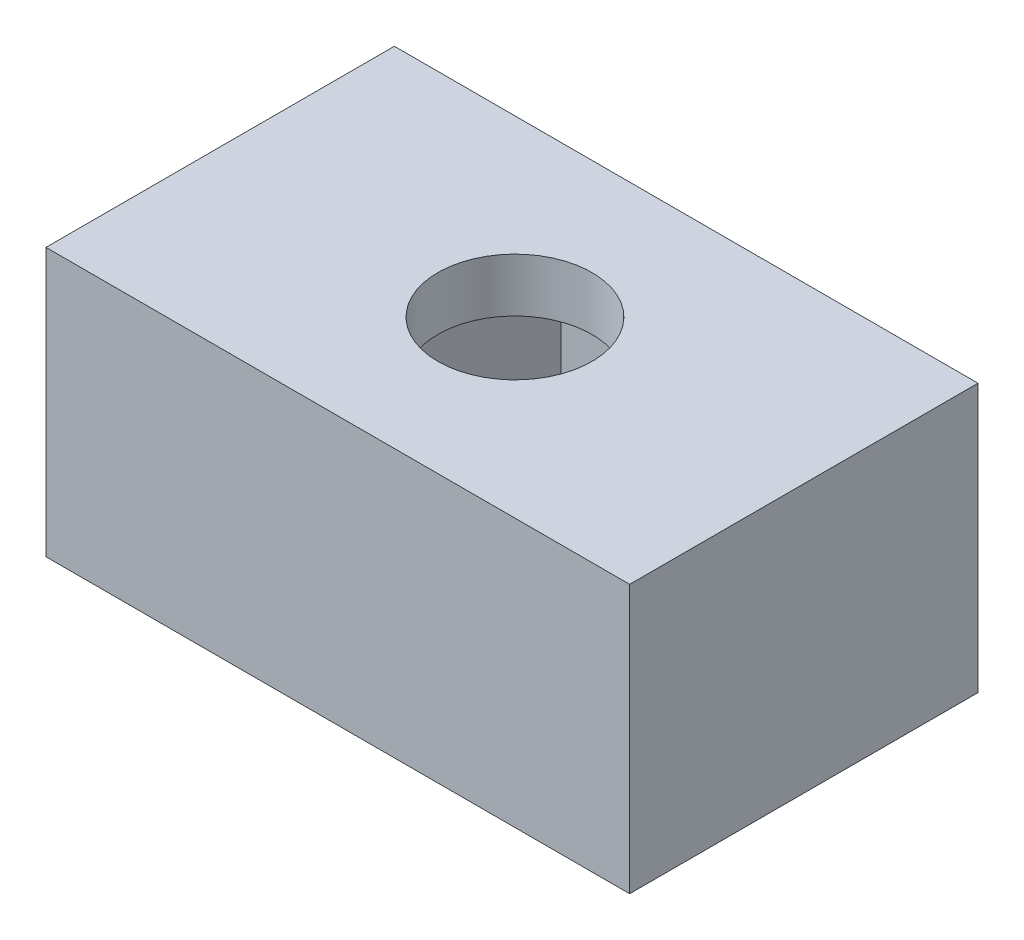
ISO-10303-21;
HEADER;
FILE_DESCRIPTION(('STEP AP214'),'2;1');
FILE_NAME('part.step','',(''),(''),'','','');
FILE_SCHEMA(('AUTOMOTIVE_DESIGN { 1 0 10303 214 1 1 1 1 }'));
ENDSEC;
DATA;
#1=APPLICATION_CONTEXT('core data for automotive mechanical design processes');
#2=APPLICATION_PROTOCOL_DEFINITION('international standard','automotive_design',2000,#1);
#3=PRODUCT_CONTEXT('',#1,'mechanical');
#4=PRODUCT('Part','Part','',(#3));
#5=PRODUCT_RELATED_PRODUCT_CATEGORY('part','',(#4));
#6=PRODUCT_DEFINITION_FORMATION('','',#4);
#7=PRODUCT_DEFINITION_CONTEXT('part definition',#1,'design');
#8=PRODUCT_DEFINITION('design','',#6,#7);
#9=PRODUCT_DEFINITION_SHAPE('','',#8);
#10=(LENGTH_UNIT() NAMED_UNIT(*) SI_UNIT(.MILLI.,.METRE.));
#11=(NAMED_UNIT(*) PLANE_ANGLE_UNIT() SI_UNIT($,.RADIAN.));
#12=(NAMED_UNIT(*) SI_UNIT($,.STERADIAN.) SOLID_ANGLE_UNIT());
#13=UNCERTAINTY_MEASURE_WITH_UNIT(LENGTH_MEASURE(1.E-05),#10,'distance_accuracy_value','');
#14=(GEOMETRIC_REPRESENTATION_CONTEXT(3) GLOBAL_UNCERTAINTY_ASSIGNED_CONTEXT((#13)) GLOBAL_UNIT_ASSIGNED_CONTEXT((#10,
#11,#12)) REPRESENTATION_CONTEXT('',''));
#15=CARTESIAN_POINT('',(0.,0.,0.));
#16=DIRECTION('',(0.,0.,1.));
#17=DIRECTION('',(1.,0.,0.));
#18=AXIS2_PLACEMENT_3D('',#15,#16,#17);
#19=CARTESIAN_POINT('',(0.,0.,0.));
#20=DIRECTION('',(0.,1.,0.));
#21=DIRECTION('',(0.,0.,1.));
#22=AXIS2_PLACEMENT_3D('',#19,#20,#21);
#23=PLANE('',#22);
#24=DIRECTION('',(0.499999999999999,0.,0.866025403784439));
#25=VECTOR('',#24,1.);
#26=CARTESIAN_POINT('',(-20.676537180436,0.,0.));
#27=LINE('',#26,#25);
#28=CARTESIAN_POINT('',(-20.676537180436,0.,0.));
#29=VERTEX_POINT('',#28);
#30=CARTESIAN_POINT('',(-18.338268590218,0.,4.05000000000001));
#31=VERTEX_POINT('',#30);
#32=EDGE_CURVE('E54',#29,#31,#27,.T.);
#33=ORIENTED_EDGE('',*,*,#32,.T.);
#34=DIRECTION('',(1.,0.,0.));
#35=VECTOR('',#34,1.);
#36=CARTESIAN_POINT('',(-18.338268590218,0.,4.05000000000001));
#37=LINE('',#36,#35);
#38=CARTESIAN_POINT('',(-13.661731409782,0.,4.05000000000001));
#39=VERTEX_POINT('',#38);
#40=EDGE_CURVE('E150',#31,#39,#37,.T.);
#41=ORIENTED_EDGE('',*,*,#40,.T.);
#42=DIRECTION('',(0.5,0.,-0.866025403784439));
#43=VECTOR('',#42,1.);
#44=CARTESIAN_POINT('',(-13.661731409782,0.,4.05000000000001));
#45=LINE('',#44,#43);
#46=CARTESIAN_POINT('',(-11.323462819564,0.,0.));
#47=VERTEX_POINT('',#46);
#48=EDGE_CURVE('E175',#39,#47,#45,.T.);
#49=ORIENTED_EDGE('',*,*,#48,.T.);
#50=DIRECTION('',(-0.5,0.,-0.866025403784439));
#51=VECTOR('',#50,1.);
#52=CARTESIAN_POINT('',(-11.323462819564,0.,0.));
#53=LINE('',#52,#51);
#54=CARTESIAN_POINT('',(-13.661731409782,0.,-4.04999999999999));
#55=VERTEX_POINT('',#54);
#56=EDGE_CURVE('E178',#47,#55,#53,.T.);
#57=ORIENTED_EDGE('',*,*,#56,.T.);
#58=DIRECTION('',(-1.,0.,0.));
#59=VECTOR('',#58,1.);
#60=CARTESIAN_POINT('',(-13.661731409782,0.,-4.04999999999999));
#61=LINE('',#60,#59);
#62=CARTESIAN_POINT('',(-18.338268590218,0.,-4.04999999999999));
#63=VERTEX_POINT('',#62);
#64=EDGE_CURVE('E181',#55,#63,#61,.T.);
#65=ORIENTED_EDGE('',*,*,#64,.T.);
#66=DIRECTION('',(-0.5,0.,0.866025403784439));
#67=VECTOR('',#66,1.);
#68=CARTESIAN_POINT('',(-18.338268590218,0.,-4.04999999999999));
#69=LINE('',#68,#67);
#70=EDGE_CURVE('E162',#63,#29,#69,.T.);
#71=ORIENTED_EDGE('',*,*,#70,.T.);
#72=EDGE_LOOP('',(#33,#41,#49,#57,#65,#71));
#73=FACE_BOUND('',#72,.T.);
#74=DIRECTION('',(1.,0.,0.));
#75=VECTOR('',#74,1.);
#76=CARTESIAN_POINT('',(-27.,0.,-6.5));
#77=LINE('',#76,#75);
#78=CARTESIAN_POINT('',(-27.,0.,-6.5));
#79=VERTEX_POINT('',#78);
#80=CARTESIAN_POINT('',(-5.22,0.,-6.5));
#81=VERTEX_POINT('',#80);
#82=EDGE_CURVE('E133',#79,#81,#77,.T.);
#83=ORIENTED_EDGE('',*,*,#82,.T.);
#84=DIRECTION('',(0.,0.,1.));
#85=VECTOR('',#84,1.);
#86=CARTESIAN_POINT('',(-5.22,0.,0.));
#87=LINE('',#86,#85);
#88=CARTESIAN_POINT('',(-5.22,0.,6.5));
#89=VERTEX_POINT('',#88);
#90=EDGE_CURVE('E122',#81,#89,#87,.T.);
#91=ORIENTED_EDGE('',*,*,#90,.T.);
#92=DIRECTION('',(1.,0.,0.));
#93=VECTOR('',#92,1.);
#94=CARTESIAN_POINT('',(-27.,0.,6.5));
#95=LINE('',#94,#93);
#96=CARTESIAN_POINT('',(-27.,0.,6.5));
#97=VERTEX_POINT('',#96);
#98=EDGE_CURVE('E121',#97,#89,#95,.T.);
#99=ORIENTED_EDGE('',*,*,#98,.F.);
#100=DIRECTION('',(0.,0.,1.));
#101=VECTOR('',#100,1.);
#102=CARTESIAN_POINT('',(-27.,0.,-6.5));
#103=LINE('',#102,#101);
#104=EDGE_CURVE('E137',#79,#97,#103,.T.);
#105=ORIENTED_EDGE('',*,*,#104,.F.);
#106=EDGE_LOOP('',(#83,#91,#99,#105));
#107=FACE_BOUND('',#106,.T.);
#108=ADVANCED_FACE('F32',(#73,#107),#23,.F.);
#109=CARTESIAN_POINT('',(-27.,10.,-6.5));
#110=DIRECTION('',(1.,0.,0.));
#111=DIRECTION('',(0.,0.,-1.));
#112=AXIS2_PLACEMENT_3D('',#109,#110,#111);
#113=PLANE('',#112);
#114=ORIENTED_EDGE('',*,*,#104,.T.);
#115=DIRECTION('',(0.,-1.,0.));
#116=VECTOR('',#115,1.);
#117=CARTESIAN_POINT('',(-27.,10.,6.5));
#118=LINE('',#117,#116);
#119=CARTESIAN_POINT('',(-27.,10.,6.5));
#120=VERTEX_POINT('',#119);
#121=EDGE_CURVE('E40',#120,#97,#118,.T.);
#122=ORIENTED_EDGE('',*,*,#121,.F.);
#123=DIRECTION('',(0.,0.,1.));
#124=VECTOR('',#123,1.);
#125=CARTESIAN_POINT('',(-27.,10.,-6.5));
#126=LINE('',#125,#124);
#127=CARTESIAN_POINT('',(-27.,10.,-6.5));
#128=VERTEX_POINT('',#127);
#129=EDGE_CURVE('E127',#128,#120,#126,.T.);
#130=ORIENTED_EDGE('',*,*,#129,.F.);
#131=DIRECTION('',(0.,-1.,0.));
#132=VECTOR('',#131,1.);
#133=CARTESIAN_POINT('',(-27.,10.,-6.5));
#134=LINE('',#133,#132);
#135=EDGE_CURVE('E131',#128,#79,#134,.T.);
#136=ORIENTED_EDGE('',*,*,#135,.T.);
#137=EDGE_LOOP('',(#114,#122,#130,#136));
#138=FACE_BOUND('',#137,.T.);
#139=ADVANCED_FACE('F34',(#138),#113,.F.);
#140=CARTESIAN_POINT('',(-27.,10.,6.5));
#141=DIRECTION('',(0.,0.,-1.));
#142=DIRECTION('',(-1.,0.,0.));
#143=AXIS2_PLACEMENT_3D('',#140,#141,#142);
#144=PLANE('',#143);
#145=ORIENTED_EDGE('',*,*,#98,.T.);
#146=DIRECTION('',(0.,1.,0.));
#147=VECTOR('',#146,1.);
#148=CARTESIAN_POINT('',(-5.22,10.,6.5));
#149=LINE('',#148,#147);
#150=CARTESIAN_POINT('',(-5.22,10.,6.5));
#151=VERTEX_POINT('',#150);
#152=EDGE_CURVE('E109',#89,#151,#149,.T.);
#153=ORIENTED_EDGE('',*,*,#152,.T.);
#154=DIRECTION('',(1.,0.,0.));
#155=VECTOR('',#154,1.);
#156=CARTESIAN_POINT('',(-27.,10.,6.5));
#157=LINE('',#156,#155);
#158=EDGE_CURVE('E119',#120,#151,#157,.T.);
#159=ORIENTED_EDGE('',*,*,#158,.F.);
#160=ORIENTED_EDGE('',*,*,#121,.T.);
#161=EDGE_LOOP('',(#145,#153,#159,#160));
#162=FACE_BOUND('',#161,.T.);
#163=ADVANCED_FACE('F117',(#162),#144,.F.);
#164=CARTESIAN_POINT('',(-27.,10.,-6.5));
#165=DIRECTION('',(0.,0.,-1.));
#166=DIRECTION('',(-1.,0.,0.));
#167=AXIS2_PLACEMENT_3D('',#164,#165,#166);
#168=PLANE('',#167);
#169=DIRECTION('',(0.,1.,0.));
#170=VECTOR('',#169,1.);
#171=CARTESIAN_POINT('',(-5.22,10.,-6.5));
#172=LINE('',#171,#170);
#173=CARTESIAN_POINT('',(-5.22,10.,-6.5));
#174=VERTEX_POINT('',#173);
#175=EDGE_CURVE('E46',#81,#174,#172,.T.);
#176=ORIENTED_EDGE('',*,*,#175,.F.);
#177=ORIENTED_EDGE('',*,*,#82,.F.);
#178=ORIENTED_EDGE('',*,*,#135,.F.);
#179=DIRECTION('',(1.,0.,0.));
#180=VECTOR('',#179,1.);
#181=CARTESIAN_POINT('',(-27.,10.,-6.5));
#182=LINE('',#181,#180);
#183=EDGE_CURVE('E129',#128,#174,#182,.T.);
#184=ORIENTED_EDGE('',*,*,#183,.T.);
#185=EDGE_LOOP('',(#176,#177,#178,#184));
#186=FACE_BOUND('',#185,.T.);
#187=ADVANCED_FACE('F240',(#186),#168,.T.);
#188=CARTESIAN_POINT('',(0.,10.,0.));
#189=DIRECTION('',(0.,1.,0.));
#190=DIRECTION('',(0.,0.,1.));
#191=AXIS2_PLACEMENT_3D('',#188,#189,#190);
#192=PLANE('',#191);
#193=DIRECTION('',(0.,0.,1.));
#194=VECTOR('',#193,1.);
#195=CARTESIAN_POINT('',(-5.22,10.,0.));
#196=LINE('',#195,#194);
#197=EDGE_CURVE('E11',#174,#151,#196,.T.);
#198=ORIENTED_EDGE('',*,*,#197,.F.);
#199=ORIENTED_EDGE('',*,*,#183,.F.);
#200=ORIENTED_EDGE('',*,*,#129,.T.);
#201=ORIENTED_EDGE('',*,*,#158,.T.);
#202=EDGE_LOOP('',(#198,#199,#200,#201));
#203=FACE_BOUND('',#202,.T.);
#204=CARTESIAN_POINT('',(-16.,10.,0.));
#205=DIRECTION('',(0.,1.,0.));
#206=DIRECTION('',(0.,0.,1.));
#207=AXIS2_PLACEMENT_3D('',#204,#205,#206);
#208=CIRCLE('',#207,2.875);
#209=CARTESIAN_POINT('',(-16.,10.,2.875));
#210=VERTEX_POINT('',#209);
#211=EDGE_CURVE('E147',#210,#210,#208,.T.);
#212=ORIENTED_EDGE('',*,*,#211,.F.);
#213=EDGE_LOOP('',(#212));
#214=FACE_BOUND('',#213,.T.);
#215=ADVANCED_FACE('F124',(#203,#214),#192,.T.);
#216=CARTESIAN_POINT('',(-20.676537180436,8.,0.));
#217=DIRECTION('',(0.866025403784439,0.,-0.499999999999999));
#218=DIRECTION('',(-0.499999999999999,0.,-0.866025403784439));
#219=AXIS2_PLACEMENT_3D('',#216,#217,#218);
#220=PLANE('',#219);
#221=ORIENTED_EDGE('',*,*,#32,.F.);
#222=DIRECTION('',(0.,-1.,0.));
#223=VECTOR('',#222,1.);
#224=CARTESIAN_POINT('',(-20.676537180436,8.,0.));
#225=LINE('',#224,#223);
#226=CARTESIAN_POINT('',(-20.676537180436,8.,0.));
#227=VERTEX_POINT('',#226);
#228=EDGE_CURVE('E171',#227,#29,#225,.T.);
#229=ORIENTED_EDGE('',*,*,#228,.F.);
#230=DIRECTION('',(0.499999999999999,0.,0.866025403784439));
#231=VECTOR('',#230,1.);
#232=CARTESIAN_POINT('',(-20.676537180436,8.,0.));
#233=LINE('',#232,#231);
#234=CARTESIAN_POINT('',(-18.338268590218,8.,4.05000000000001));
#235=VERTEX_POINT('',#234);
#236=EDGE_CURVE('E158',#227,#235,#233,.T.);
#237=ORIENTED_EDGE('',*,*,#236,.T.);
#238=DIRECTION('',(0.,-1.,0.));
#239=VECTOR('',#238,1.);
#240=CARTESIAN_POINT('',(-18.338268590218,8.,4.05000000000001));
#241=LINE('',#240,#239);
#242=EDGE_CURVE('E140',#235,#31,#241,.T.);
#243=ORIENTED_EDGE('',*,*,#242,.T.);
#244=EDGE_LOOP('',(#221,#229,#237,#243));
#245=FACE_BOUND('',#244,.T.);
#246=ADVANCED_FACE('F195',(#245),#220,.T.);
#247=CARTESIAN_POINT('',(-18.338268590218,8.,4.05000000000001));
#248=DIRECTION('',(0.,0.,-1.));
#249=DIRECTION('',(-1.,0.,0.));
#250=AXIS2_PLACEMENT_3D('',#247,#248,#249);
#251=PLANE('',#250);
#252=ORIENTED_EDGE('',*,*,#40,.F.);
#253=ORIENTED_EDGE('',*,*,#242,.F.);
#254=DIRECTION('',(1.,0.,0.));
#255=VECTOR('',#254,1.);
#256=CARTESIAN_POINT('',(-18.338268590218,8.,4.05000000000001));
#257=LINE('',#256,#255);
#258=CARTESIAN_POINT('',(-13.661731409782,8.,4.05000000000001));
#259=VERTEX_POINT('',#258);
#260=EDGE_CURVE('E161',#235,#259,#257,.T.);
#261=ORIENTED_EDGE('',*,*,#260,.T.);
#262=DIRECTION('',(0.,-1.,0.));
#263=VECTOR('',#262,1.);
#264=CARTESIAN_POINT('',(-13.661731409782,8.,4.05000000000001));
#265=LINE('',#264,#263);
#266=EDGE_CURVE('E193',#259,#39,#265,.T.);
#267=ORIENTED_EDGE('',*,*,#266,.T.);
#268=EDGE_LOOP('',(#252,#253,#261,#267));
#269=FACE_BOUND('',#268,.T.);
#270=ADVANCED_FACE('F212',(#269),#251,.T.);
#271=CARTESIAN_POINT('',(-13.661731409782,8.,4.05000000000001));
#272=DIRECTION('',(-0.866025403784439,0.,-0.5));
#273=DIRECTION('',(-0.5,0.,0.866025403784439));
#274=AXIS2_PLACEMENT_3D('',#271,#272,#273);
#275=PLANE('',#274);
#276=ORIENTED_EDGE('',*,*,#48,.F.);
#277=ORIENTED_EDGE('',*,*,#266,.F.);
#278=DIRECTION('',(0.5,0.,-0.866025403784439));
#279=VECTOR('',#278,1.);
#280=CARTESIAN_POINT('',(-13.661731409782,8.,4.05000000000001));
#281=LINE('',#280,#279);
#282=CARTESIAN_POINT('',(-11.323462819564,8.,0.));
#283=VERTEX_POINT('',#282);
#284=EDGE_CURVE('E164',#259,#283,#281,.T.);
#285=ORIENTED_EDGE('',*,*,#284,.T.);
#286=DIRECTION('',(0.,-1.,0.));
#287=VECTOR('',#286,1.);
#288=CARTESIAN_POINT('',(-11.323462819564,8.,0.));
#289=LINE('',#288,#287);
#290=EDGE_CURVE('E191',#283,#47,#289,.T.);
#291=ORIENTED_EDGE('',*,*,#290,.T.);
#292=EDGE_LOOP('',(#276,#277,#285,#291));
#293=FACE_BOUND('',#292,.T.);
#294=ADVANCED_FACE('F215',(#293),#275,.T.);
#295=CARTESIAN_POINT('',(-11.323462819564,8.,0.));
#296=DIRECTION('',(-0.866025403784439,0.,0.5));
#297=DIRECTION('',(0.5,0.,0.866025403784439));
#298=AXIS2_PLACEMENT_3D('',#295,#296,#297);
#299=PLANE('',#298);
#300=ORIENTED_EDGE('',*,*,#56,.F.);
#301=ORIENTED_EDGE('',*,*,#290,.F.);
#302=DIRECTION('',(-0.5,0.,-0.866025403784439));
#303=VECTOR('',#302,1.);
#304=CARTESIAN_POINT('',(-11.323462819564,8.,0.));
#305=LINE('',#304,#303);
#306=CARTESIAN_POINT('',(-13.661731409782,8.,-4.04999999999999));
#307=VERTEX_POINT('',#306);
#308=EDGE_CURVE('E166',#283,#307,#305,.T.);
#309=ORIENTED_EDGE('',*,*,#308,.T.);
#310=DIRECTION('',(0.,-1.,0.));
#311=VECTOR('',#310,1.);
#312=CARTESIAN_POINT('',(-13.661731409782,8.,-4.04999999999999));
#313=LINE('',#312,#311);
#314=EDGE_CURVE('E189',#307,#55,#313,.T.);
#315=ORIENTED_EDGE('',*,*,#314,.T.);
#316=EDGE_LOOP('',(#300,#301,#309,#315));
#317=FACE_BOUND('',#316,.T.);
#318=ADVANCED_FACE('F219',(#317),#299,.T.);
#319=CARTESIAN_POINT('',(-13.661731409782,8.,-4.04999999999999));
#320=DIRECTION('',(0.,0.,1.));
#321=DIRECTION('',(1.,0.,0.));
#322=AXIS2_PLACEMENT_3D('',#319,#320,#321);
#323=PLANE('',#322);
#324=ORIENTED_EDGE('',*,*,#64,.F.);
#325=ORIENTED_EDGE('',*,*,#314,.F.);
#326=DIRECTION('',(-1.,0.,0.));
#327=VECTOR('',#326,1.);
#328=CARTESIAN_POINT('',(-13.661731409782,8.,-4.04999999999999));
#329=LINE('',#328,#327);
#330=CARTESIAN_POINT('',(-18.338268590218,8.,-4.04999999999999));
#331=VERTEX_POINT('',#330);
#332=EDGE_CURVE('E168',#307,#331,#329,.T.);
#333=ORIENTED_EDGE('',*,*,#332,.T.);
#334=DIRECTION('',(0.,-1.,0.));
#335=VECTOR('',#334,1.);
#336=CARTESIAN_POINT('',(-18.338268590218,8.,-4.04999999999999));
#337=LINE('',#336,#335);
#338=EDGE_CURVE('E187',#331,#63,#337,.T.);
#339=ORIENTED_EDGE('',*,*,#338,.T.);
#340=EDGE_LOOP('',(#324,#325,#333,#339));
#341=FACE_BOUND('',#340,.T.);
#342=ADVANCED_FACE('F222',(#341),#323,.T.);
#343=CARTESIAN_POINT('',(-18.338268590218,8.,-4.04999999999999));
#344=DIRECTION('',(0.866025403784439,0.,0.5));
#345=DIRECTION('',(0.5,0.,-0.866025403784439));
#346=AXIS2_PLACEMENT_3D('',#343,#344,#345);
#347=PLANE('',#346);
#348=ORIENTED_EDGE('',*,*,#70,.F.);
#349=ORIENTED_EDGE('',*,*,#338,.F.);
#350=DIRECTION('',(-0.5,0.,0.866025403784439));
#351=VECTOR('',#350,1.);
#352=CARTESIAN_POINT('',(-18.338268590218,8.,-4.04999999999999));
#353=LINE('',#352,#351);
#354=EDGE_CURVE('E170',#331,#227,#353,.T.);
#355=ORIENTED_EDGE('',*,*,#354,.T.);
#356=ORIENTED_EDGE('',*,*,#228,.T.);
#357=EDGE_LOOP('',(#348,#349,#355,#356));
#358=FACE_BOUND('',#357,.T.);
#359=ADVANCED_FACE('F204',(#358),#347,.T.);
#360=CARTESIAN_POINT('',(0.,8.,0.));
#361=DIRECTION('',(0.,1.,0.));
#362=DIRECTION('',(0.,0.,1.));
#363=AXIS2_PLACEMENT_3D('',#360,#361,#362);
#364=PLANE('',#363);
#365=CARTESIAN_POINT('',(-16.,8.,0.));
#366=DIRECTION('',(0.,1.,0.));
#367=DIRECTION('',(0.,0.,1.));
#368=AXIS2_PLACEMENT_3D('',#365,#366,#367);
#369=CIRCLE('',#368,2.875);
#370=CARTESIAN_POINT('',(-16.,8.,2.875));
#371=VERTEX_POINT('',#370);
#372=EDGE_CURVE('E145',#371,#371,#369,.F.);
#373=ORIENTED_EDGE('',*,*,#372,.F.);
#374=EDGE_LOOP('',(#373));
#375=FACE_BOUND('',#374,.T.);
#376=ORIENTED_EDGE('',*,*,#236,.F.);
#377=ORIENTED_EDGE('',*,*,#354,.F.);
#378=ORIENTED_EDGE('',*,*,#332,.F.);
#379=ORIENTED_EDGE('',*,*,#308,.F.);
#380=ORIENTED_EDGE('',*,*,#284,.F.);
#381=ORIENTED_EDGE('',*,*,#260,.F.);
#382=EDGE_LOOP('',(#376,#377,#378,#379,#380,#381));
#383=FACE_BOUND('',#382,.T.);
#384=ADVANCED_FACE('F207',(#375,#383),#364,.F.);
#385=CARTESIAN_POINT('',(-16.,10.,0.));
#386=DIRECTION('',(0.,-1.,0.));
#387=DIRECTION('',(0.,0.,-1.));
#388=AXIS2_PLACEMENT_3D('',#385,#386,#387);
#389=CYLINDRICAL_SURFACE('',#388,2.875);
#390=ORIENTED_EDGE('',*,*,#211,.T.);
#391=EDGE_LOOP('',(#390));
#392=FACE_BOUND('',#391,.T.);
#393=ORIENTED_EDGE('',*,*,#372,.T.);
#394=EDGE_LOOP('',(#393));
#395=FACE_BOUND('',#394,.T.);
#396=ADVANCED_FACE('F298',(#392,#395),#389,.F.);
#397=CARTESIAN_POINT('',(-5.22,0.,0.));
#398=DIRECTION('',(-1.,0.,0.));
#399=DIRECTION('',(0.,0.,1.));
#400=AXIS2_PLACEMENT_3D('',#397,#398,#399);
#401=PLANE('',#400);
#402=ORIENTED_EDGE('',*,*,#175,.T.);
#403=ORIENTED_EDGE('',*,*,#197,.T.);
#404=ORIENTED_EDGE('',*,*,#152,.F.);
#405=ORIENTED_EDGE('',*,*,#90,.F.);
#406=EDGE_LOOP('',(#402,#403,#404,#405));
#407=FACE_BOUND('',#406,.T.);
#408=ADVANCED_FACE('F108',(#407),#401,.F.);
#409=CLOSED_SHELL('',(#108,#139,#163,#187,#215,#246,#270,#294,#318,#342,#359,#384,#396,#408));
#410=MANIFOLD_SOLID_BREP('B2',#409);
#411=ADVANCED_BREP_SHAPE_REPRESENTATION('',(#18,#410),#14);
#412=SHAPE_DEFINITION_REPRESENTATION(#9,#411);
ENDSEC;
END-ISO-10303-21;
